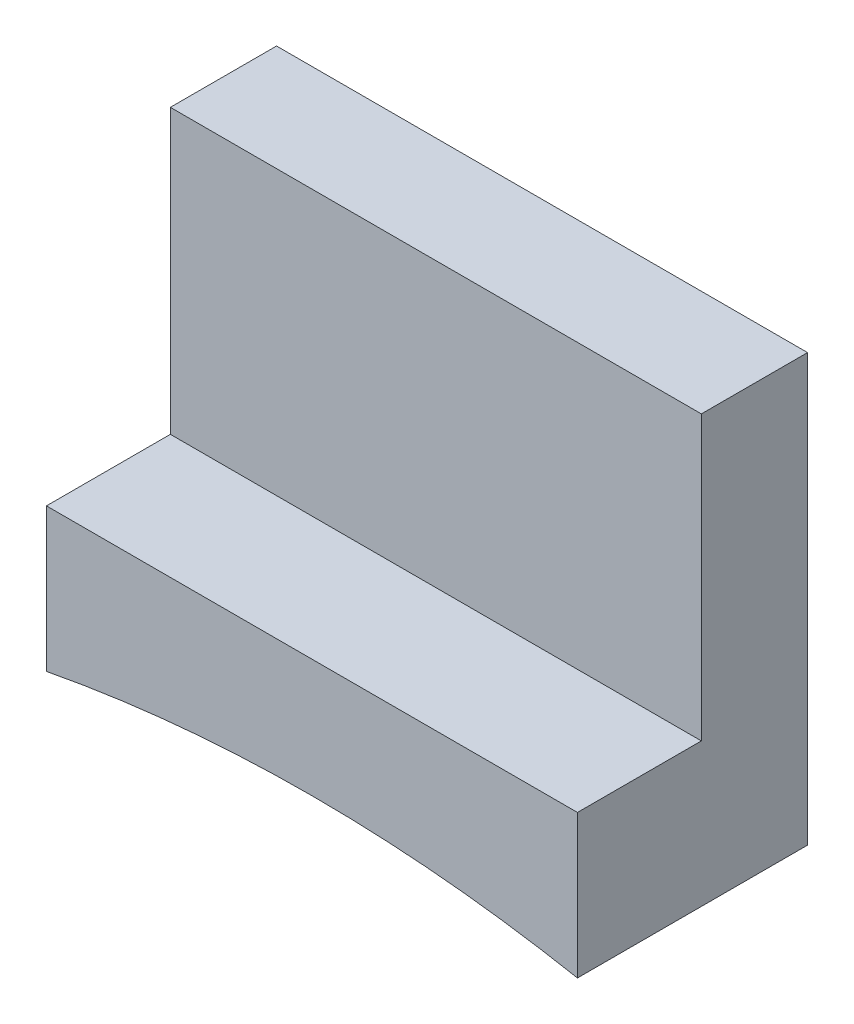
ISO-10303-21;
HEADER;
FILE_DESCRIPTION(('STEP AP214'),'2;1');
FILE_NAME('part.step','',(''),(''),'','','');
FILE_SCHEMA(('AUTOMOTIVE_DESIGN { 1 0 10303 214 1 1 1 1 }'));
ENDSEC;
DATA;
#1=APPLICATION_CONTEXT('core data for automotive mechanical design processes');
#2=APPLICATION_PROTOCOL_DEFINITION('international standard','automotive_design',2000,#1);
#3=PRODUCT_CONTEXT('',#1,'mechanical');
#4=PRODUCT('Part','Part','',(#3));
#5=PRODUCT_RELATED_PRODUCT_CATEGORY('part','',(#4));
#6=PRODUCT_DEFINITION_FORMATION('','',#4);
#7=PRODUCT_DEFINITION_CONTEXT('part definition',#1,'design');
#8=PRODUCT_DEFINITION('design','',#6,#7);
#9=PRODUCT_DEFINITION_SHAPE('','',#8);
#10=(LENGTH_UNIT() NAMED_UNIT(*) SI_UNIT(.MILLI.,.METRE.));
#11=(NAMED_UNIT(*) PLANE_ANGLE_UNIT() SI_UNIT($,.RADIAN.));
#12=(NAMED_UNIT(*) SI_UNIT($,.STERADIAN.) SOLID_ANGLE_UNIT());
#13=UNCERTAINTY_MEASURE_WITH_UNIT(LENGTH_MEASURE(1.E-05),#10,'distance_accuracy_value','');
#14=(GEOMETRIC_REPRESENTATION_CONTEXT(3) GLOBAL_UNCERTAINTY_ASSIGNED_CONTEXT((#13)) GLOBAL_UNIT_ASSIGNED_CONTEXT((#10,
#11,#12)) REPRESENTATION_CONTEXT('',''));
#15=CARTESIAN_POINT('',(0.,0.,0.));
#16=DIRECTION('',(0.,0.,1.));
#17=DIRECTION('',(1.,0.,0.));
#18=AXIS2_PLACEMENT_3D('',#15,#16,#17);
#19=CARTESIAN_POINT('',(0.,1.,0.));
#20=DIRECTION('',(0.,-1.,0.));
#21=DIRECTION('',(0.,0.,-1.));
#22=AXIS2_PLACEMENT_3D('',#19,#20,#21);
#23=PLANE('',#22);
#24=DIRECTION('',(1.,0.,0.));
#25=VECTOR('',#24,1.);
#26=CARTESIAN_POINT('',(0.,1.,-3.5));
#27=LINE('',#26,#25);
#28=CARTESIAN_POINT('',(0.,1.,-3.5));
#29=VERTEX_POINT('',#28);
#30=CARTESIAN_POINT('',(15.,1.,-3.5));
#31=VERTEX_POINT('',#30);
#32=EDGE_CURVE('E55',#29,#31,#27,.T.);
#33=ORIENTED_EDGE('',*,*,#32,.F.);
#34=DIRECTION('',(0.,0.,1.));
#35=VECTOR('',#34,1.);
#36=CARTESIAN_POINT('',(0.,1.,0.));
#37=LINE('',#36,#35);
#38=CARTESIAN_POINT('',(0.,1.,0.));
#39=VERTEX_POINT('',#38);
#40=EDGE_CURVE('E114',#29,#39,#37,.T.);
#41=ORIENTED_EDGE('',*,*,#40,.T.);
#42=DIRECTION('',(1.,0.,0.));
#43=VECTOR('',#42,1.);
#44=CARTESIAN_POINT('',(0.,1.,0.));
#45=LINE('',#44,#43);
#46=CARTESIAN_POINT('',(15.,1.,0.));
#47=VERTEX_POINT('',#46);
#48=EDGE_CURVE('E60',#39,#47,#45,.T.);
#49=ORIENTED_EDGE('',*,*,#48,.T.);
#50=DIRECTION('',(0.,0.,-1.));
#51=VECTOR('',#50,1.);
#52=CARTESIAN_POINT('',(15.,1.,0.));
#53=LINE('',#52,#51);
#54=EDGE_CURVE('E141',#47,#31,#53,.T.);
#55=ORIENTED_EDGE('',*,*,#54,.T.);
#56=EDGE_LOOP('',(#33,#41,#49,#55));
#57=FACE_BOUND('',#56,.T.);
#58=ADVANCED_FACE('F39',(#57),#23,.F.);
#59=CARTESIAN_POINT('',(0.,1.,0.));
#60=DIRECTION('',(1.,0.,0.));
#61=DIRECTION('',(0.,0.,-1.));
#62=AXIS2_PLACEMENT_3D('',#59,#60,#61);
#63=PLANE('',#62);
#64=DIRECTION('',(0.,-1.,0.));
#65=VECTOR('',#64,1.);
#66=CARTESIAN_POINT('',(0.,1.,-6.5));
#67=LINE('',#66,#65);
#68=CARTESIAN_POINT('',(0.,9.,-6.5));
#69=VERTEX_POINT('',#68);
#70=CARTESIAN_POINT('',(0.,-3.05029447892493,-6.5));
#71=VERTEX_POINT('',#70);
#72=EDGE_CURVE('E144',#69,#71,#67,.T.);
#73=ORIENTED_EDGE('',*,*,#72,.T.);
#74=DIRECTION('',(0.,0.,-1.));
#75=VECTOR('',#74,1.);
#76=CARTESIAN_POINT('',(0.,-3.05029447892493,0.));
#77=LINE('',#76,#75);
#78=CARTESIAN_POINT('',(0.,-3.05029447892493,0.));
#79=VERTEX_POINT('',#78);
#80=EDGE_CURVE('E133',#79,#71,#77,.T.);
#81=ORIENTED_EDGE('',*,*,#80,.F.);
#82=DIRECTION('',(0.,-1.,0.));
#83=VECTOR('',#82,1.);
#84=CARTESIAN_POINT('',(0.,1.,0.));
#85=LINE('',#84,#83);
#86=EDGE_CURVE('E11',#39,#79,#85,.T.);
#87=ORIENTED_EDGE('',*,*,#86,.F.);
#88=ORIENTED_EDGE('',*,*,#40,.F.);
#89=DIRECTION('',(0.,-1.,0.));
#90=VECTOR('',#89,1.);
#91=CARTESIAN_POINT('',(0.,9.,-3.5));
#92=LINE('',#91,#90);
#93=CARTESIAN_POINT('',(0.,9.,-3.5));
#94=VERTEX_POINT('',#93);
#95=EDGE_CURVE('E95',#94,#29,#92,.T.);
#96=ORIENTED_EDGE('',*,*,#95,.F.);
#97=DIRECTION('',(0.,0.,1.));
#98=VECTOR('',#97,1.);
#99=CARTESIAN_POINT('',(0.,9.,-6.5));
#100=LINE('',#99,#98);
#101=EDGE_CURVE('E103',#69,#94,#100,.T.);
#102=ORIENTED_EDGE('',*,*,#101,.F.);
#103=EDGE_LOOP('',(#73,#81,#87,#88,#96,#102));
#104=FACE_BOUND('',#103,.T.);
#105=ADVANCED_FACE('F41',(#104),#63,.F.);
#106=CARTESIAN_POINT('',(0.,1.,0.));
#107=DIRECTION('',(0.,0.,-1.));
#108=DIRECTION('',(-1.,0.,0.));
#109=AXIS2_PLACEMENT_3D('',#106,#107,#108);
#110=PLANE('',#109);
#111=ORIENTED_EDGE('',*,*,#86,.T.);
#112=CARTESIAN_POINT('',(7.5,-42.3408785926792,0.));
#113=DIRECTION('',(0.,0.,1.));
#114=DIRECTION('',(1.,0.,0.));
#115=AXIS2_PLACEMENT_3D('',#112,#113,#114);
#116=CIRCLE('',#115,40.);
#117=CARTESIAN_POINT('',(15.,-3.05029447892493,0.));
#118=VERTEX_POINT('',#117);
#119=EDGE_CURVE('E121',#118,#79,#116,.T.);
#120=ORIENTED_EDGE('',*,*,#119,.F.);
#121=DIRECTION('',(0.,-1.,0.));
#122=VECTOR('',#121,1.);
#123=CARTESIAN_POINT('',(15.,1.,0.));
#124=LINE('',#123,#122);
#125=EDGE_CURVE('E48',#47,#118,#124,.T.);
#126=ORIENTED_EDGE('',*,*,#125,.F.);
#127=ORIENTED_EDGE('',*,*,#48,.F.);
#128=EDGE_LOOP('',(#111,#120,#126,#127));
#129=FACE_BOUND('',#128,.T.);
#130=ADVANCED_FACE('F159',(#129),#110,.F.);
#131=CARTESIAN_POINT('',(15.,1.,0.));
#132=DIRECTION('',(-1.,0.,0.));
#133=DIRECTION('',(0.,0.,1.));
#134=AXIS2_PLACEMENT_3D('',#131,#132,#133);
#135=PLANE('',#134);
#136=ORIENTED_EDGE('',*,*,#125,.T.);
#137=DIRECTION('',(0.,0.,-1.));
#138=VECTOR('',#137,1.);
#139=CARTESIAN_POINT('',(15.,-3.05029447892493,0.));
#140=LINE('',#139,#138);
#141=CARTESIAN_POINT('',(15.,-3.05029447892493,-6.5));
#142=VERTEX_POINT('',#141);
#143=EDGE_CURVE('E128',#118,#142,#140,.T.);
#144=ORIENTED_EDGE('',*,*,#143,.T.);
#145=DIRECTION('',(0.,-1.,0.));
#146=VECTOR('',#145,1.);
#147=CARTESIAN_POINT('',(15.,1.,-6.5));
#148=LINE('',#147,#146);
#149=CARTESIAN_POINT('',(15.,9.,-6.5));
#150=VERTEX_POINT('',#149);
#151=EDGE_CURVE('E147',#150,#142,#148,.T.);
#152=ORIENTED_EDGE('',*,*,#151,.F.);
#153=DIRECTION('',(0.,0.,-1.));
#154=VECTOR('',#153,1.);
#155=CARTESIAN_POINT('',(15.,9.,-6.5));
#156=LINE('',#155,#154);
#157=CARTESIAN_POINT('',(15.,9.,-3.5));
#158=VERTEX_POINT('',#157);
#159=EDGE_CURVE('E102',#158,#150,#156,.T.);
#160=ORIENTED_EDGE('',*,*,#159,.F.);
#161=DIRECTION('',(0.,-1.,0.));
#162=VECTOR('',#161,1.);
#163=CARTESIAN_POINT('',(15.,9.,-3.5));
#164=LINE('',#163,#162);
#165=EDGE_CURVE('E97',#158,#31,#164,.T.);
#166=ORIENTED_EDGE('',*,*,#165,.T.);
#167=ORIENTED_EDGE('',*,*,#54,.F.);
#168=EDGE_LOOP('',(#136,#144,#152,#160,#166,#167));
#169=FACE_BOUND('',#168,.T.);
#170=ADVANCED_FACE('F153',(#169),#135,.F.);
#171=CARTESIAN_POINT('',(0.,1.,-6.5));
#172=DIRECTION('',(0.,0.,1.));
#173=DIRECTION('',(1.,0.,0.));
#174=AXIS2_PLACEMENT_3D('',#171,#172,#173);
#175=PLANE('',#174);
#176=ORIENTED_EDGE('',*,*,#151,.T.);
#177=CARTESIAN_POINT('',(7.5,-42.3408785926792,-6.5));
#178=DIRECTION('',(0.,0.,1.));
#179=DIRECTION('',(1.,0.,0.));
#180=AXIS2_PLACEMENT_3D('',#177,#178,#179);
#181=CIRCLE('',#180,40.);
#182=EDGE_CURVE('E116',#142,#71,#181,.T.);
#183=ORIENTED_EDGE('',*,*,#182,.T.);
#184=ORIENTED_EDGE('',*,*,#72,.F.);
#185=DIRECTION('',(-1.,0.,0.));
#186=VECTOR('',#185,1.);
#187=CARTESIAN_POINT('',(0.,9.,-6.5));
#188=LINE('',#187,#186);
#189=EDGE_CURVE('E109',#150,#69,#188,.T.);
#190=ORIENTED_EDGE('',*,*,#189,.F.);
#191=EDGE_LOOP('',(#176,#183,#184,#190));
#192=FACE_BOUND('',#191,.T.);
#193=ADVANCED_FACE('F162',(#192),#175,.F.);
#194=CARTESIAN_POINT('',(7.5,-42.3408785926792,0.));
#195=DIRECTION('',(0.,0.,-1.));
#196=DIRECTION('',(-1.,0.,0.));
#197=AXIS2_PLACEMENT_3D('',#194,#195,#196);
#198=CYLINDRICAL_SURFACE('',#197,40.);
#199=ORIENTED_EDGE('',*,*,#182,.F.);
#200=ORIENTED_EDGE('',*,*,#143,.F.);
#201=ORIENTED_EDGE('',*,*,#119,.T.);
#202=ORIENTED_EDGE('',*,*,#80,.T.);
#203=EDGE_LOOP('',(#199,#200,#201,#202));
#204=FACE_BOUND('',#203,.T.);
#205=ADVANCED_FACE('F158',(#204),#198,.F.);
#206=CARTESIAN_POINT('',(0.,9.,-3.5));
#207=DIRECTION('',(0.,0.,-1.));
#208=DIRECTION('',(-1.,0.,0.));
#209=AXIS2_PLACEMENT_3D('',#206,#207,#208);
#210=PLANE('',#209);
#211=ORIENTED_EDGE('',*,*,#32,.T.);
#212=ORIENTED_EDGE('',*,*,#165,.F.);
#213=DIRECTION('',(1.,0.,0.));
#214=VECTOR('',#213,1.);
#215=CARTESIAN_POINT('',(0.,9.,-3.5));
#216=LINE('',#215,#214);
#217=EDGE_CURVE('E91',#94,#158,#216,.T.);
#218=ORIENTED_EDGE('',*,*,#217,.F.);
#219=ORIENTED_EDGE('',*,*,#95,.T.);
#220=EDGE_LOOP('',(#211,#212,#218,#219));
#221=FACE_BOUND('',#220,.T.);
#222=ADVANCED_FACE('F93',(#221),#210,.F.);
#223=CARTESIAN_POINT('',(0.,9.,0.));
#224=DIRECTION('',(0.,1.,0.));
#225=DIRECTION('',(0.,0.,1.));
#226=AXIS2_PLACEMENT_3D('',#223,#224,#225);
#227=PLANE('',#226);
#228=ORIENTED_EDGE('',*,*,#101,.T.);
#229=ORIENTED_EDGE('',*,*,#217,.T.);
#230=ORIENTED_EDGE('',*,*,#159,.T.);
#231=ORIENTED_EDGE('',*,*,#189,.T.);
#232=EDGE_LOOP('',(#228,#229,#230,#231));
#233=FACE_BOUND('',#232,.T.);
#234=ADVANCED_FACE('F107',(#233),#227,.T.);
#235=CLOSED_SHELL('',(#58,#105,#130,#170,#193,#205,#222,#234));
#236=MANIFOLD_SOLID_BREP('B2',#235);
#237=ADVANCED_BREP_SHAPE_REPRESENTATION('',(#18,#236),#14);
#238=SHAPE_DEFINITION_REPRESENTATION(#9,#237);
ENDSEC;
END-ISO-10303-21;
